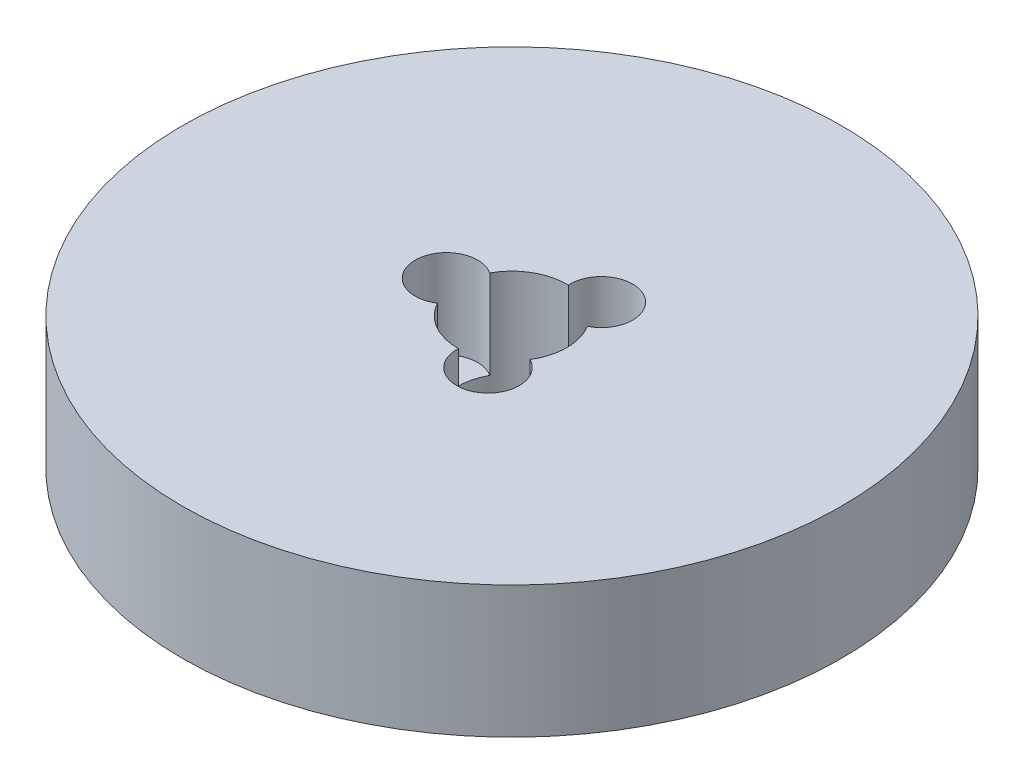
ISO-10303-21;
HEADER;
FILE_DESCRIPTION(('STEP AP214'),'2;1');
FILE_NAME('part.step','',(''),(''),'','','');
FILE_SCHEMA(('AUTOMOTIVE_DESIGN { 1 0 10303 214 1 1 1 1 }'));
ENDSEC;
DATA;
#1=APPLICATION_CONTEXT('core data for automotive mechanical design processes');
#2=APPLICATION_PROTOCOL_DEFINITION('international standard','automotive_design',2000,#1);
#3=PRODUCT_CONTEXT('',#1,'mechanical');
#4=PRODUCT('Part','Part','',(#3));
#5=PRODUCT_RELATED_PRODUCT_CATEGORY('part','',(#4));
#6=PRODUCT_DEFINITION_FORMATION('','',#4);
#7=PRODUCT_DEFINITION_CONTEXT('part definition',#1,'design');
#8=PRODUCT_DEFINITION('design','',#6,#7);
#9=PRODUCT_DEFINITION_SHAPE('','',#8);
#10=(LENGTH_UNIT() NAMED_UNIT(*) SI_UNIT(.MILLI.,.METRE.));
#11=(NAMED_UNIT(*) PLANE_ANGLE_UNIT() SI_UNIT($,.RADIAN.));
#12=(NAMED_UNIT(*) SI_UNIT($,.STERADIAN.) SOLID_ANGLE_UNIT());
#13=UNCERTAINTY_MEASURE_WITH_UNIT(LENGTH_MEASURE(1.E-05),#10,'distance_accuracy_value','');
#14=(GEOMETRIC_REPRESENTATION_CONTEXT(3) GLOBAL_UNCERTAINTY_ASSIGNED_CONTEXT((#13)) GLOBAL_UNIT_ASSIGNED_CONTEXT((#10,
#11,#12)) REPRESENTATION_CONTEXT('',''));
#15=CARTESIAN_POINT('',(0.,0.,0.));
#16=DIRECTION('',(0.,0.,1.));
#17=DIRECTION('',(1.,0.,0.));
#18=AXIS2_PLACEMENT_3D('',#15,#16,#17);
#19=CARTESIAN_POINT('',(0.,24.,0.));
#20=DIRECTION('',(0.,-1.,0.));
#21=DIRECTION('',(0.,0.,-1.));
#22=AXIS2_PLACEMENT_3D('',#19,#20,#21);
#23=CYLINDRICAL_SURFACE('',#22,60.);
#24=CARTESIAN_POINT('',(0.,24.,0.));
#25=DIRECTION('',(0.,1.,0.));
#26=DIRECTION('',(0.,0.,1.));
#27=AXIS2_PLACEMENT_3D('',#24,#25,#26);
#28=CIRCLE('',#27,60.);
#29=CARTESIAN_POINT('',(0.,24.,60.));
#30=VERTEX_POINT('',#29);
#31=EDGE_CURVE('E126',#30,#30,#28,.T.);
#32=ORIENTED_EDGE('',*,*,#31,.F.);
#33=EDGE_LOOP('',(#32));
#34=FACE_BOUND('',#33,.T.);
#35=CARTESIAN_POINT('',(0.,0.,0.));
#36=DIRECTION('',(0.,1.,0.));
#37=DIRECTION('',(0.,0.,1.));
#38=AXIS2_PLACEMENT_3D('',#35,#36,#37);
#39=CIRCLE('',#38,60.);
#40=CARTESIAN_POINT('',(0.,0.,60.));
#41=VERTEX_POINT('',#40);
#42=EDGE_CURVE('E124',#41,#41,#39,.T.);
#43=ORIENTED_EDGE('',*,*,#42,.T.);
#44=EDGE_LOOP('',(#43));
#45=FACE_BOUND('',#44,.T.);
#46=ADVANCED_FACE('F39',(#34,#45),#23,.T.);
#47=CARTESIAN_POINT('',(0.,24.,0.));
#48=DIRECTION('',(0.,1.,0.));
#49=DIRECTION('',(0.,0.,1.));
#50=AXIS2_PLACEMENT_3D('',#47,#48,#49);
#51=PLANE('',#50);
#52=CARTESIAN_POINT('',(5.96041180362805,24.,10.3237360779169));
#53=DIRECTION('',(0.,1.,0.));
#54=DIRECTION('',(0.866025403784436,0.,-0.500000000000004));
#55=AXIS2_PLACEMENT_3D('',#52,#53,#54);
#56=CIRCLE('',#55,5.69574790191964);
#57=CARTESIAN_POINT('',(0.274086758170099,24.,9.9962431167412));
#58=VERTEX_POINT('',#57);
#59=CARTESIAN_POINT('',(8.51995710241821,24.,5.23548765378675));
#60=VERTEX_POINT('',#59);
#61=EDGE_CURVE('E147',#58,#60,#56,.T.);
#62=ORIENTED_EDGE('',*,*,#61,.F.);
#63=CARTESIAN_POINT('',(0.,24.,0.));
#64=DIRECTION('',(0.,1.,0.));
#65=DIRECTION('',(0.,0.,1.));
#66=AXIS2_PLACEMENT_3D('',#63,#64,#65);
#67=CIRCLE('',#66,10.);
#68=CARTESIAN_POINT('',(-8.79404386058824,24.,4.76075546295441));
#69=VERTEX_POINT('',#68);
#70=EDGE_CURVE('E118',#69,#58,#67,.T.);
#71=ORIENTED_EDGE('',*,*,#70,.F.);
#72=CARTESIAN_POINT('',(-11.920823607256,24.,0.));
#73=DIRECTION('',(0.,1.,0.));
#74=DIRECTION('',(0.,0.,1.));
#75=AXIS2_PLACEMENT_3D('',#72,#73,#74);
#76=CIRCLE('',#75,5.69574790191964);
#77=CARTESIAN_POINT('',(-8.79404386058824,24.,-4.76075546295441));
#78=VERTEX_POINT('',#77);
#79=EDGE_CURVE('E113',#78,#69,#76,.T.);
#80=ORIENTED_EDGE('',*,*,#79,.F.);
#81=CARTESIAN_POINT('',(0.274086758169959,24.,-9.9962431167412));
#82=VERTEX_POINT('',#81);
#83=EDGE_CURVE('E106',#82,#78,#67,.T.);
#84=ORIENTED_EDGE('',*,*,#83,.F.);
#85=CARTESIAN_POINT('',(5.96041180362791,24.,-10.323736077917));
#86=DIRECTION('',(0.,1.,0.));
#87=DIRECTION('',(-0.866025403784443,0.,-0.499999999999992));
#88=AXIS2_PLACEMENT_3D('',#85,#86,#87);
#89=CIRCLE('',#88,5.69574790191964);
#90=CARTESIAN_POINT('',(8.51995710241814,24.,-5.23548765378687));
#91=VERTEX_POINT('',#90);
#92=EDGE_CURVE('E90',#91,#82,#89,.T.);
#93=ORIENTED_EDGE('',*,*,#92,.F.);
#94=EDGE_CURVE('E116',#60,#91,#67,.T.);
#95=ORIENTED_EDGE('',*,*,#94,.F.);
#96=EDGE_LOOP('',(#62,#71,#80,#84,#93,#95));
#97=FACE_BOUND('',#96,.T.);
#98=ORIENTED_EDGE('',*,*,#31,.T.);
#99=EDGE_LOOP('',(#98));
#100=FACE_BOUND('',#99,.T.);
#101=ADVANCED_FACE('F115',(#97,#100),#51,.T.);
#102=CARTESIAN_POINT('',(0.,0.,0.));
#103=DIRECTION('',(0.,1.,0.));
#104=DIRECTION('',(0.,0.,1.));
#105=AXIS2_PLACEMENT_3D('',#102,#103,#104);
#106=PLANE('',#105);
#107=CARTESIAN_POINT('',(0.,0.,0.));
#108=DIRECTION('',(0.,1.,0.));
#109=DIRECTION('',(0.,0.,1.));
#110=AXIS2_PLACEMENT_3D('',#107,#108,#109);
#111=CIRCLE('',#110,10.);
#112=CARTESIAN_POINT('',(0.,0.,10.));
#113=VERTEX_POINT('',#112);
#114=EDGE_CURVE('E120',#113,#113,#111,.T.);
#115=ORIENTED_EDGE('',*,*,#114,.T.);
#116=EDGE_LOOP('',(#115));
#117=FACE_BOUND('',#116,.T.);
#118=ORIENTED_EDGE('',*,*,#42,.F.);
#119=EDGE_LOOP('',(#118));
#120=FACE_BOUND('',#119,.T.);
#121=ADVANCED_FACE('F164',(#117,#120),#106,.F.);
#122=CARTESIAN_POINT('',(0.,24.,0.));
#123=DIRECTION('',(0.,-1.,0.));
#124=DIRECTION('',(0.,0.,-1.));
#125=AXIS2_PLACEMENT_3D('',#122,#123,#124);
#126=CYLINDRICAL_SURFACE('',#125,10.);
#127=DIRECTION('',(0.,1.,0.));
#128=VECTOR('',#127,1.);
#129=CARTESIAN_POINT('',(0.274086758170099,15.9234927100109,9.9962431167412));
#130=LINE('',#129,#128);
#131=CARTESIAN_POINT('',(0.274086758170099,7.84698542002182,9.9962431167412));
#132=VERTEX_POINT('',#131);
#133=EDGE_CURVE('E11',#132,#58,#130,.T.);
#134=ORIENTED_EDGE('',*,*,#133,.F.);
#135=CARTESIAN_POINT('',(0.,7.84698542002182,0.));
#136=DIRECTION('',(0.,1.,0.));
#137=DIRECTION('',(0.,0.,1.));
#138=AXIS2_PLACEMENT_3D('',#135,#136,#137);
#139=CIRCLE('',#138,10.);
#140=CARTESIAN_POINT('',(8.51995710241821,7.84698542002182,5.23548765378675));
#141=VERTEX_POINT('',#140);
#142=EDGE_CURVE('E144',#132,#141,#139,.T.);
#143=ORIENTED_EDGE('',*,*,#142,.T.);
#144=DIRECTION('',(0.,1.,0.));
#145=VECTOR('',#144,1.);
#146=CARTESIAN_POINT('',(8.51995710241821,15.9234927100109,5.23548765378675));
#147=LINE('',#146,#145);
#148=EDGE_CURVE('E46',#60,#141,#147,.F.);
#149=ORIENTED_EDGE('',*,*,#148,.F.);
#150=ORIENTED_EDGE('',*,*,#94,.T.);
#151=DIRECTION('',(0.,1.,0.));
#152=VECTOR('',#151,1.);
#153=CARTESIAN_POINT('',(8.51995710241814,15.9234927100109,-5.23548765378687));
#154=LINE('',#153,#152);
#155=CARTESIAN_POINT('',(8.51995710241814,7.84698542002182,-5.23548765378687));
#156=VERTEX_POINT('',#155);
#157=EDGE_CURVE('E92',#156,#91,#154,.T.);
#158=ORIENTED_EDGE('',*,*,#157,.F.);
#159=CARTESIAN_POINT('',(0.,7.84698542002182,0.));
#160=DIRECTION('',(0.,1.,0.));
#161=DIRECTION('',(0.,0.,1.));
#162=AXIS2_PLACEMENT_3D('',#159,#160,#161);
#163=CIRCLE('',#162,10.);
#164=CARTESIAN_POINT('',(0.274086758169959,7.84698542002182,-9.9962431167412));
#165=VERTEX_POINT('',#164);
#166=EDGE_CURVE('E107',#156,#165,#163,.T.);
#167=ORIENTED_EDGE('',*,*,#166,.T.);
#168=DIRECTION('',(0.,1.,0.));
#169=VECTOR('',#168,1.);
#170=CARTESIAN_POINT('',(0.274086758169958,15.9234927100109,-9.9962431167412));
#171=LINE('',#170,#169);
#172=EDGE_CURVE('E95',#82,#165,#171,.F.);
#173=ORIENTED_EDGE('',*,*,#172,.F.);
#174=ORIENTED_EDGE('',*,*,#83,.T.);
#175=DIRECTION('',(0.,1.,0.));
#176=VECTOR('',#175,1.);
#177=CARTESIAN_POINT('',(-8.79404386058824,15.9234927100109,-4.76075546295441));
#178=LINE('',#177,#176);
#179=CARTESIAN_POINT('',(-8.79404386058824,7.84698542002182,-4.76075546295441));
#180=VERTEX_POINT('',#179);
#181=EDGE_CURVE('E143',#180,#78,#178,.T.);
#182=ORIENTED_EDGE('',*,*,#181,.F.);
#183=CARTESIAN_POINT('',(0.,7.84698542002182,0.));
#184=DIRECTION('',(0.,1.,0.));
#185=DIRECTION('',(0.,0.,1.));
#186=AXIS2_PLACEMENT_3D('',#183,#184,#185);
#187=CIRCLE('',#186,10.);
#188=CARTESIAN_POINT('',(-8.79404386058824,7.84698542002182,4.76075546295441));
#189=VERTEX_POINT('',#188);
#190=EDGE_CURVE('E132',#180,#189,#187,.T.);
#191=ORIENTED_EDGE('',*,*,#190,.T.);
#192=DIRECTION('',(0.,1.,0.));
#193=VECTOR('',#192,1.);
#194=CARTESIAN_POINT('',(-8.79404386058824,15.9234927100109,4.76075546295441));
#195=LINE('',#194,#193);
#196=EDGE_CURVE('E137',#69,#189,#195,.F.);
#197=ORIENTED_EDGE('',*,*,#196,.F.);
#198=ORIENTED_EDGE('',*,*,#70,.T.);
#199=EDGE_LOOP('',(#134,#143,#149,#150,#158,#167,#173,#174,#182,#191,#197,#198));
#200=FACE_BOUND('',#199,.T.);
#201=ORIENTED_EDGE('',*,*,#114,.F.);
#202=EDGE_LOOP('',(#201));
#203=FACE_BOUND('',#202,.T.);
#204=ADVANCED_FACE('F103',(#200,#203),#126,.F.);
#205=CARTESIAN_POINT('',(-11.920823607256,7.84698542002182,0.));
#206=DIRECTION('',(0.,1.,0.));
#207=DIRECTION('',(0.,0.,1.));
#208=AXIS2_PLACEMENT_3D('',#205,#206,#207);
#209=CYLINDRICAL_SURFACE('',#208,5.69574790191964);
#210=ORIENTED_EDGE('',*,*,#181,.T.);
#211=ORIENTED_EDGE('',*,*,#79,.T.);
#212=ORIENTED_EDGE('',*,*,#196,.T.);
#213=CARTESIAN_POINT('',(-11.920823607256,7.84698542002182,0.));
#214=DIRECTION('',(0.,1.,0.));
#215=DIRECTION('',(0.,0.,1.));
#216=AXIS2_PLACEMENT_3D('',#213,#214,#215);
#217=CIRCLE('',#216,5.69574790191964);
#218=EDGE_CURVE('E121',#180,#189,#217,.T.);
#219=ORIENTED_EDGE('',*,*,#218,.F.);
#220=EDGE_LOOP('',(#210,#211,#212,#219));
#221=FACE_BOUND('',#220,.T.);
#222=ADVANCED_FACE('F174',(#221),#209,.F.);
#223=CARTESIAN_POINT('',(-11.920823607256,7.84698542002182,0.));
#224=DIRECTION('',(0.,1.,0.));
#225=DIRECTION('',(0.,0.,1.));
#226=AXIS2_PLACEMENT_3D('',#223,#224,#225);
#227=PLANE('',#226);
#228=ORIENTED_EDGE('',*,*,#218,.T.);
#229=ORIENTED_EDGE('',*,*,#190,.F.);
#230=EDGE_LOOP('',(#228,#229));
#231=FACE_BOUND('',#230,.T.);
#232=ADVANCED_FACE('F177',(#231),#227,.T.);
#233=CARTESIAN_POINT('',(5.96041180362791,7.84698542002182,-10.323736077917));
#234=DIRECTION('',(0.,1.,0.));
#235=DIRECTION('',(0.,0.,1.));
#236=AXIS2_PLACEMENT_3D('',#233,#234,#235);
#237=CYLINDRICAL_SURFACE('',#236,5.69574790191964);
#238=ORIENTED_EDGE('',*,*,#157,.T.);
#239=ORIENTED_EDGE('',*,*,#92,.T.);
#240=ORIENTED_EDGE('',*,*,#172,.T.);
#241=CARTESIAN_POINT('',(5.96041180362791,7.84698542002182,-10.323736077917));
#242=DIRECTION('',(0.,1.,0.));
#243=DIRECTION('',(-0.866025403784443,0.,-0.499999999999992));
#244=AXIS2_PLACEMENT_3D('',#241,#242,#243);
#245=CIRCLE('',#244,5.69574790191964);
#246=EDGE_CURVE('E56',#156,#165,#245,.T.);
#247=ORIENTED_EDGE('',*,*,#246,.F.);
#248=EDGE_LOOP('',(#238,#239,#240,#247));
#249=FACE_BOUND('',#248,.T.);
#250=ADVANCED_FACE('F93',(#249),#237,.F.);
#251=CARTESIAN_POINT('',(5.96041180362791,7.84698542002182,-10.323736077917));
#252=DIRECTION('',(0.,1.,0.));
#253=DIRECTION('',(-0.866025403784443,0.,-0.499999999999992));
#254=AXIS2_PLACEMENT_3D('',#251,#252,#253);
#255=PLANE('',#254);
#256=ORIENTED_EDGE('',*,*,#246,.T.);
#257=ORIENTED_EDGE('',*,*,#166,.F.);
#258=EDGE_LOOP('',(#256,#257));
#259=FACE_BOUND('',#258,.T.);
#260=ADVANCED_FACE('F160',(#259),#255,.T.);
#261=CARTESIAN_POINT('',(5.96041180362805,7.84698542002182,10.3237360779169));
#262=DIRECTION('',(0.,1.,0.));
#263=DIRECTION('',(0.,0.,1.));
#264=AXIS2_PLACEMENT_3D('',#261,#262,#263);
#265=CYLINDRICAL_SURFACE('',#264,5.69574790191964);
#266=ORIENTED_EDGE('',*,*,#133,.T.);
#267=ORIENTED_EDGE('',*,*,#61,.T.);
#268=ORIENTED_EDGE('',*,*,#148,.T.);
#269=CARTESIAN_POINT('',(5.96041180362805,7.84698542002182,10.3237360779169));
#270=DIRECTION('',(0.,1.,0.));
#271=DIRECTION('',(0.866025403784436,0.,-0.500000000000004));
#272=AXIS2_PLACEMENT_3D('',#269,#270,#271);
#273=CIRCLE('',#272,5.69574790191964);
#274=EDGE_CURVE('E55',#132,#141,#273,.T.);
#275=ORIENTED_EDGE('',*,*,#274,.F.);
#276=EDGE_LOOP('',(#266,#267,#268,#275));
#277=FACE_BOUND('',#276,.T.);
#278=ADVANCED_FACE('F149',(#277),#265,.F.);
#279=CARTESIAN_POINT('',(5.96041180362805,7.84698542002182,10.3237360779169));
#280=DIRECTION('',(0.,1.,0.));
#281=DIRECTION('',(0.866025403784436,0.,-0.500000000000004));
#282=AXIS2_PLACEMENT_3D('',#279,#280,#281);
#283=PLANE('',#282);
#284=ORIENTED_EDGE('',*,*,#274,.T.);
#285=ORIENTED_EDGE('',*,*,#142,.F.);
#286=EDGE_LOOP('',(#284,#285));
#287=FACE_BOUND('',#286,.T.);
#288=ADVANCED_FACE('F151',(#287),#283,.T.);
#289=CLOSED_SHELL('',(#46,#101,#121,#204,#222,#232,#250,#260,#278,#288));
#290=MANIFOLD_SOLID_BREP('B2',#289);
#291=ADVANCED_BREP_SHAPE_REPRESENTATION('',(#18,#290),#14);
#292=SHAPE_DEFINITION_REPRESENTATION(#9,#291);
ENDSEC;
END-ISO-10303-21;
